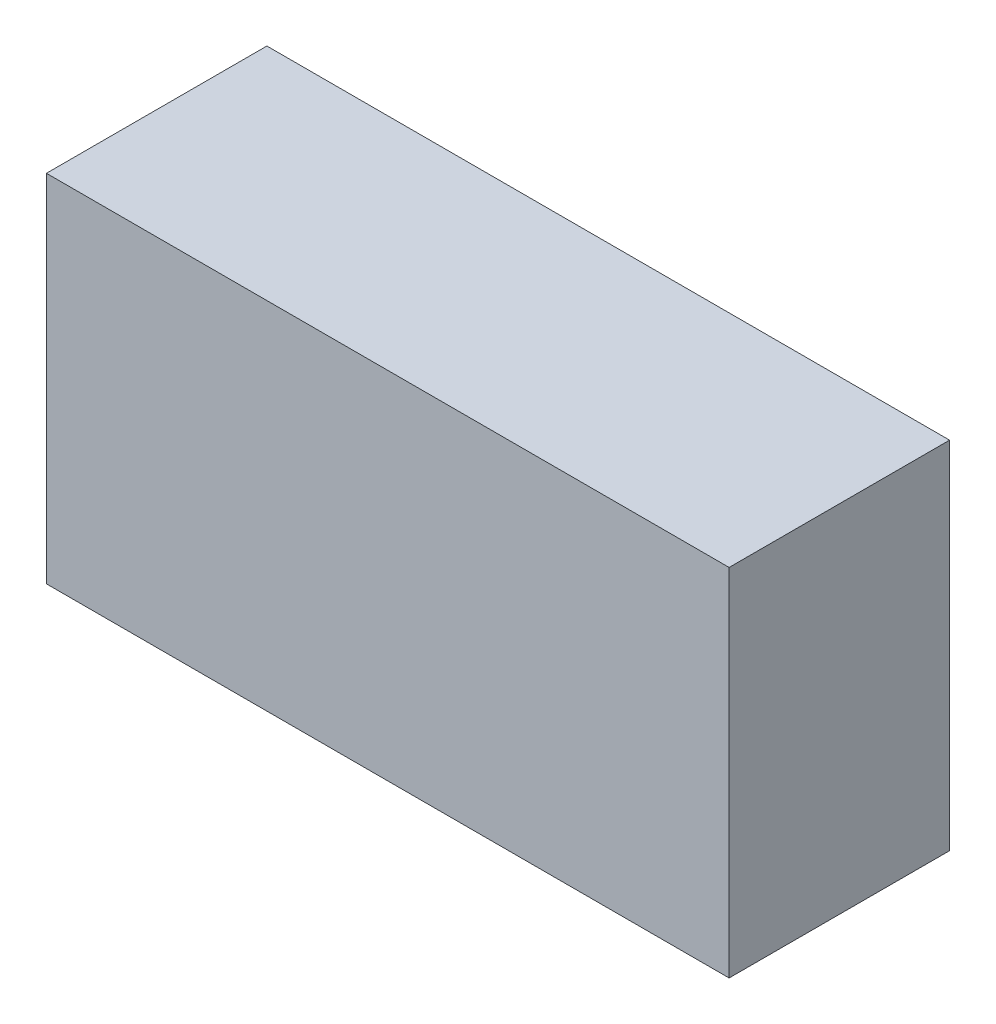
ISO-10303-21;
HEADER;
FILE_DESCRIPTION(('STEP AP214'),'2;1');
FILE_NAME('part.step','',(''),(''),'','','');
FILE_SCHEMA(('AUTOMOTIVE_DESIGN { 1 0 10303 214 1 1 1 1 }'));
ENDSEC;
DATA;
#1=APPLICATION_CONTEXT('core data for automotive mechanical design processes');
#2=APPLICATION_PROTOCOL_DEFINITION('international standard','automotive_design',2000,#1);
#3=PRODUCT_CONTEXT('',#1,'mechanical');
#4=PRODUCT('Part','Part','',(#3));
#5=PRODUCT_RELATED_PRODUCT_CATEGORY('part','',(#4));
#6=PRODUCT_DEFINITION_FORMATION('','',#4);
#7=PRODUCT_DEFINITION_CONTEXT('part definition',#1,'design');
#8=PRODUCT_DEFINITION('design','',#6,#7);
#9=PRODUCT_DEFINITION_SHAPE('','',#8);
#10=(LENGTH_UNIT() NAMED_UNIT(*) SI_UNIT(.MILLI.,.METRE.));
#11=(NAMED_UNIT(*) PLANE_ANGLE_UNIT() SI_UNIT($,.RADIAN.));
#12=(NAMED_UNIT(*) SI_UNIT($,.STERADIAN.) SOLID_ANGLE_UNIT());
#13=UNCERTAINTY_MEASURE_WITH_UNIT(LENGTH_MEASURE(1.E-05),#10,'distance_accuracy_value','');
#14=(GEOMETRIC_REPRESENTATION_CONTEXT(3) GLOBAL_UNCERTAINTY_ASSIGNED_CONTEXT((#13)) GLOBAL_UNIT_ASSIGNED_CONTEXT((#10,
#11,#12)) REPRESENTATION_CONTEXT('',''));
#15=CARTESIAN_POINT('',(0.,0.,0.));
#16=DIRECTION('',(0.,0.,1.));
#17=DIRECTION('',(1.,0.,0.));
#18=AXIS2_PLACEMENT_3D('',#15,#16,#17);
#19=CARTESIAN_POINT('',(-0.48,-0.25,0.33));
#20=DIRECTION('',(-1.,0.,0.));
#21=DIRECTION('',(0.,0.,1.));
#22=AXIS2_PLACEMENT_3D('',#19,#20,#21);
#23=PLANE('',#22);
#24=DIRECTION('',(0.,1.,0.));
#25=VECTOR('',#24,1.);
#26=CARTESIAN_POINT('',(-0.48,-0.25,0.33));
#27=LINE('',#26,#25);
#28=CARTESIAN_POINT('',(-0.48,-0.25,0.33));
#29=VERTEX_POINT('',#28);
#30=CARTESIAN_POINT('',(-0.48,0.25,0.33));
#31=VERTEX_POINT('',#30);
#32=EDGE_CURVE('E11',#29,#31,#27,.T.);
#33=ORIENTED_EDGE('',*,*,#32,.T.);
#34=DIRECTION('',(0.,0.,1.));
#35=VECTOR('',#34,1.);
#36=CARTESIAN_POINT('',(-0.48,0.25,0.33));
#37=LINE('',#36,#35);
#38=CARTESIAN_POINT('',(-0.48,0.25,0.02));
#39=VERTEX_POINT('',#38);
#40=EDGE_CURVE('E24',#39,#31,#37,.T.);
#41=ORIENTED_EDGE('',*,*,#40,.F.);
#42=DIRECTION('',(0.,1.,0.));
#43=VECTOR('',#42,1.);
#44=CARTESIAN_POINT('',(-0.48,-0.25,0.02));
#45=LINE('',#44,#43);
#46=CARTESIAN_POINT('',(-0.48,-0.25,0.02));
#47=VERTEX_POINT('',#46);
#48=EDGE_CURVE('E86',#47,#39,#45,.T.);
#49=ORIENTED_EDGE('',*,*,#48,.F.);
#50=DIRECTION('',(0.,0.,1.));
#51=VECTOR('',#50,1.);
#52=CARTESIAN_POINT('',(-0.48,-0.25,0.33));
#53=LINE('',#52,#51);
#54=EDGE_CURVE('E84',#47,#29,#53,.T.);
#55=ORIENTED_EDGE('',*,*,#54,.T.);
#56=EDGE_LOOP('',(#33,#41,#49,#55));
#57=FACE_BOUND('',#56,.T.);
#58=ADVANCED_FACE('F17',(#57),#23,.T.);
#59=CARTESIAN_POINT('',(-0.48,-0.25,0.02));
#60=DIRECTION('',(0.,0.,-1.));
#61=DIRECTION('',(-1.,0.,0.));
#62=AXIS2_PLACEMENT_3D('',#59,#60,#61);
#63=PLANE('',#62);
#64=ORIENTED_EDGE('',*,*,#48,.T.);
#65=DIRECTION('',(-1.,0.,0.));
#66=VECTOR('',#65,1.);
#67=CARTESIAN_POINT('',(-0.48,0.25,0.02));
#68=LINE('',#67,#66);
#69=CARTESIAN_POINT('',(0.48,0.25,0.02));
#70=VERTEX_POINT('',#69);
#71=EDGE_CURVE('E81',#70,#39,#68,.T.);
#72=ORIENTED_EDGE('',*,*,#71,.F.);
#73=DIRECTION('',(0.,1.,0.));
#74=VECTOR('',#73,1.);
#75=CARTESIAN_POINT('',(0.48,-0.25,0.02));
#76=LINE('',#75,#74);
#77=CARTESIAN_POINT('',(0.48,-0.25,0.02));
#78=VERTEX_POINT('',#77);
#79=EDGE_CURVE('E79',#78,#70,#76,.T.);
#80=ORIENTED_EDGE('',*,*,#79,.F.);
#81=DIRECTION('',(-1.,0.,0.));
#82=VECTOR('',#81,1.);
#83=CARTESIAN_POINT('',(-0.48,-0.25,0.02));
#84=LINE('',#83,#82);
#85=EDGE_CURVE('E70',#78,#47,#84,.T.);
#86=ORIENTED_EDGE('',*,*,#85,.T.);
#87=EDGE_LOOP('',(#64,#72,#80,#86));
#88=FACE_BOUND('',#87,.T.);
#89=ADVANCED_FACE('F91',(#88),#63,.T.);
#90=CARTESIAN_POINT('',(0.48,-0.25,0.33));
#91=DIRECTION('',(1.,0.,0.));
#92=DIRECTION('',(0.,0.,-1.));
#93=AXIS2_PLACEMENT_3D('',#90,#91,#92);
#94=PLANE('',#93);
#95=ORIENTED_EDGE('',*,*,#79,.T.);
#96=DIRECTION('',(0.,0.,-1.));
#97=VECTOR('',#96,1.);
#98=CARTESIAN_POINT('',(0.48,0.25,0.33));
#99=LINE('',#98,#97);
#100=CARTESIAN_POINT('',(0.48,0.25,0.33));
#101=VERTEX_POINT('',#100);
#102=EDGE_CURVE('E60',#101,#70,#99,.T.);
#103=ORIENTED_EDGE('',*,*,#102,.F.);
#104=DIRECTION('',(0.,1.,0.));
#105=VECTOR('',#104,1.);
#106=CARTESIAN_POINT('',(0.48,-0.25,0.33));
#107=LINE('',#106,#105);
#108=CARTESIAN_POINT('',(0.48,-0.25,0.33));
#109=VERTEX_POINT('',#108);
#110=EDGE_CURVE('E54',#109,#101,#107,.T.);
#111=ORIENTED_EDGE('',*,*,#110,.F.);
#112=DIRECTION('',(0.,0.,-1.));
#113=VECTOR('',#112,1.);
#114=CARTESIAN_POINT('',(0.48,-0.25,0.33));
#115=LINE('',#114,#113);
#116=EDGE_CURVE('E58',#109,#78,#115,.T.);
#117=ORIENTED_EDGE('',*,*,#116,.T.);
#118=EDGE_LOOP('',(#95,#103,#111,#117));
#119=FACE_BOUND('',#118,.T.);
#120=ADVANCED_FACE('F57',(#119),#94,.T.);
#121=CARTESIAN_POINT('',(-0.48,-0.25,0.33));
#122=DIRECTION('',(0.,0.,1.));
#123=DIRECTION('',(1.,0.,0.));
#124=AXIS2_PLACEMENT_3D('',#121,#122,#123);
#125=PLANE('',#124);
#126=ORIENTED_EDGE('',*,*,#110,.T.);
#127=DIRECTION('',(1.,0.,0.));
#128=VECTOR('',#127,1.);
#129=CARTESIAN_POINT('',(-0.48,0.25,0.33));
#130=LINE('',#129,#128);
#131=EDGE_CURVE('E71',#31,#101,#130,.T.);
#132=ORIENTED_EDGE('',*,*,#131,.F.);
#133=ORIENTED_EDGE('',*,*,#32,.F.);
#134=DIRECTION('',(1.,0.,0.));
#135=VECTOR('',#134,1.);
#136=CARTESIAN_POINT('',(-0.48,-0.25,0.33));
#137=LINE('',#136,#135);
#138=EDGE_CURVE('E68',#29,#109,#137,.T.);
#139=ORIENTED_EDGE('',*,*,#138,.T.);
#140=EDGE_LOOP('',(#126,#132,#133,#139));
#141=FACE_BOUND('',#140,.T.);
#142=ADVANCED_FACE('F73',(#141),#125,.T.);
#143=CARTESIAN_POINT('',(0.,-0.25,0.));
#144=DIRECTION('',(0.,-1.,0.));
#145=DIRECTION('',(0.,0.,-1.));
#146=AXIS2_PLACEMENT_3D('',#143,#144,#145);
#147=PLANE('',#146);
#148=ORIENTED_EDGE('',*,*,#54,.F.);
#149=ORIENTED_EDGE('',*,*,#85,.F.);
#150=ORIENTED_EDGE('',*,*,#116,.F.);
#151=ORIENTED_EDGE('',*,*,#138,.F.);
#152=EDGE_LOOP('',(#148,#149,#150,#151));
#153=FACE_BOUND('',#152,.T.);
#154=ADVANCED_FACE('F67',(#153),#147,.T.);
#155=CARTESIAN_POINT('',(0.,0.25,0.));
#156=DIRECTION('',(0.,-1.,0.));
#157=DIRECTION('',(0.,0.,-1.));
#158=AXIS2_PLACEMENT_3D('',#155,#156,#157);
#159=PLANE('',#158);
#160=ORIENTED_EDGE('',*,*,#40,.T.);
#161=ORIENTED_EDGE('',*,*,#131,.T.);
#162=ORIENTED_EDGE('',*,*,#102,.T.);
#163=ORIENTED_EDGE('',*,*,#71,.T.);
#164=EDGE_LOOP('',(#160,#161,#162,#163));
#165=FACE_BOUND('',#164,.T.);
#166=ADVANCED_FACE('F89',(#165),#159,.F.);
#167=CLOSED_SHELL('',(#58,#89,#120,#142,#154,#166));
#168=MANIFOLD_SOLID_BREP('B1',#167);
#169=ADVANCED_BREP_SHAPE_REPRESENTATION('',(#18,#168),#14);
#170=SHAPE_DEFINITION_REPRESENTATION(#9,#169);
ENDSEC;
END-ISO-10303-21;
